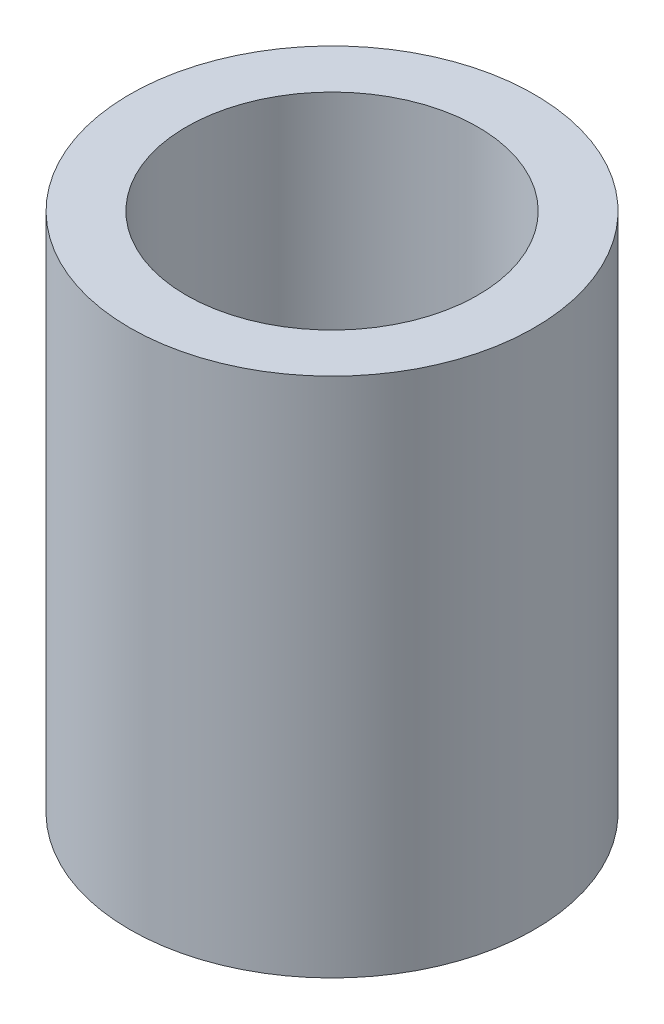
ISO-10303-21;
HEADER;
FILE_DESCRIPTION(('STEP AP214'),'2;1');
FILE_NAME('part.step','',(''),(''),'','','');
FILE_SCHEMA(('AUTOMOTIVE_DESIGN { 1 0 10303 214 1 1 1 1 }'));
ENDSEC;
DATA;
#1=APPLICATION_CONTEXT('core data for automotive mechanical design processes');
#2=APPLICATION_PROTOCOL_DEFINITION('international standard','automotive_design',2000,#1);
#3=PRODUCT_CONTEXT('',#1,'mechanical');
#4=PRODUCT('Part','Part','',(#3));
#5=PRODUCT_RELATED_PRODUCT_CATEGORY('part','',(#4));
#6=PRODUCT_DEFINITION_FORMATION('','',#4);
#7=PRODUCT_DEFINITION_CONTEXT('part definition',#1,'design');
#8=PRODUCT_DEFINITION('design','',#6,#7);
#9=PRODUCT_DEFINITION_SHAPE('','',#8);
#10=(LENGTH_UNIT() NAMED_UNIT(*) SI_UNIT(.MILLI.,.METRE.));
#11=(NAMED_UNIT(*) PLANE_ANGLE_UNIT() SI_UNIT($,.RADIAN.));
#12=(NAMED_UNIT(*) SI_UNIT($,.STERADIAN.) SOLID_ANGLE_UNIT());
#13=UNCERTAINTY_MEASURE_WITH_UNIT(LENGTH_MEASURE(1.E-05),#10,'distance_accuracy_value','');
#14=(GEOMETRIC_REPRESENTATION_CONTEXT(3) GLOBAL_UNCERTAINTY_ASSIGNED_CONTEXT((#13)) GLOBAL_UNIT_ASSIGNED_CONTEXT((#10,
#11,#12)) REPRESENTATION_CONTEXT('',''));
#15=CARTESIAN_POINT('',(0.,0.,0.));
#16=DIRECTION('',(0.,0.,1.));
#17=DIRECTION('',(1.,0.,0.));
#18=AXIS2_PLACEMENT_3D('',#15,#16,#17);
#19=CARTESIAN_POINT('',(0.,51.5398930526747,0.));
#20=DIRECTION('',(0.,-1.,0.));
#21=DIRECTION('',(0.,0.,-1.));
#22=AXIS2_PLACEMENT_3D('',#19,#20,#21);
#23=CYLINDRICAL_SURFACE('',#22,20.);
#24=CARTESIAN_POINT('',(0.,51.5398930526747,0.));
#25=DIRECTION('',(0.,1.,0.));
#26=DIRECTION('',(0.,0.,1.));
#27=AXIS2_PLACEMENT_3D('',#24,#25,#26);
#28=CIRCLE('',#27,20.);
#29=CARTESIAN_POINT('',(0.,51.5398930526747,20.));
#30=VERTEX_POINT('',#29);
#31=EDGE_CURVE('E10',#30,#30,#28,.T.);
#32=ORIENTED_EDGE('',*,*,#31,.F.);
#33=EDGE_LOOP('',(#32));
#34=FACE_BOUND('',#33,.T.);
#35=CARTESIAN_POINT('',(0.,0.,0.));
#36=DIRECTION('',(0.,1.,0.));
#37=DIRECTION('',(0.,0.,1.));
#38=AXIS2_PLACEMENT_3D('',#35,#36,#37);
#39=CIRCLE('',#38,20.);
#40=CARTESIAN_POINT('',(0.,0.,20.));
#41=VERTEX_POINT('',#40);
#42=EDGE_CURVE('E37',#41,#41,#39,.T.);
#43=ORIENTED_EDGE('',*,*,#42,.T.);
#44=EDGE_LOOP('',(#43));
#45=FACE_BOUND('',#44,.T.);
#46=ADVANCED_FACE('F40',(#34,#45),#23,.T.);
#47=CARTESIAN_POINT('',(0.,51.5398930526747,0.));
#48=DIRECTION('',(0.,1.,0.));
#49=DIRECTION('',(0.,0.,1.));
#50=AXIS2_PLACEMENT_3D('',#47,#48,#49);
#51=PLANE('',#50);
#52=CARTESIAN_POINT('',(0.,51.5398930526747,0.));
#53=DIRECTION('',(0.,1.,0.));
#54=DIRECTION('',(0.,0.,1.));
#55=AXIS2_PLACEMENT_3D('',#52,#53,#54);
#56=CIRCLE('',#55,14.4164314666222);
#57=CARTESIAN_POINT('',(0.,51.5398930526747,14.4164314666222));
#58=VERTEX_POINT('',#57);
#59=EDGE_CURVE('E50',#58,#58,#56,.T.);
#60=ORIENTED_EDGE('',*,*,#59,.F.);
#61=EDGE_LOOP('',(#60));
#62=FACE_BOUND('',#61,.T.);
#63=ORIENTED_EDGE('',*,*,#31,.T.);
#64=EDGE_LOOP('',(#63));
#65=FACE_BOUND('',#64,.T.);
#66=ADVANCED_FACE('F59',(#62,#65),#51,.T.);
#67=CARTESIAN_POINT('',(0.,0.,0.));
#68=DIRECTION('',(0.,1.,0.));
#69=DIRECTION('',(0.,0.,1.));
#70=AXIS2_PLACEMENT_3D('',#67,#68,#69);
#71=PLANE('',#70);
#72=CARTESIAN_POINT('',(0.,0.,0.));
#73=DIRECTION('',(0.,1.,0.));
#74=DIRECTION('',(0.,0.,1.));
#75=AXIS2_PLACEMENT_3D('',#72,#73,#74);
#76=CIRCLE('',#75,14.4164314666222);
#77=CARTESIAN_POINT('',(0.,0.,14.4164314666222));
#78=VERTEX_POINT('',#77);
#79=EDGE_CURVE('E47',#78,#78,#76,.T.);
#80=ORIENTED_EDGE('',*,*,#79,.T.);
#81=EDGE_LOOP('',(#80));
#82=FACE_BOUND('',#81,.T.);
#83=ORIENTED_EDGE('',*,*,#42,.F.);
#84=EDGE_LOOP('',(#83));
#85=FACE_BOUND('',#84,.T.);
#86=ADVANCED_FACE('F58',(#82,#85),#71,.F.);
#87=CARTESIAN_POINT('',(0.,51.5398930526747,0.));
#88=DIRECTION('',(0.,-1.,0.));
#89=DIRECTION('',(0.,0.,-1.));
#90=AXIS2_PLACEMENT_3D('',#87,#88,#89);
#91=CYLINDRICAL_SURFACE('',#90,14.4164314666222);
#92=ORIENTED_EDGE('',*,*,#59,.T.);
#93=EDGE_LOOP('',(#92));
#94=FACE_BOUND('',#93,.T.);
#95=ORIENTED_EDGE('',*,*,#79,.F.);
#96=EDGE_LOOP('',(#95));
#97=FACE_BOUND('',#96,.T.);
#98=ADVANCED_FACE('F54',(#94,#97),#91,.F.);
#99=CLOSED_SHELL('',(#46,#66,#86,#98));
#100=MANIFOLD_SOLID_BREP('B2',#99);
#101=ADVANCED_BREP_SHAPE_REPRESENTATION('',(#18,#100),#14);
#102=SHAPE_DEFINITION_REPRESENTATION(#9,#101);
ENDSEC;
END-ISO-10303-21;
